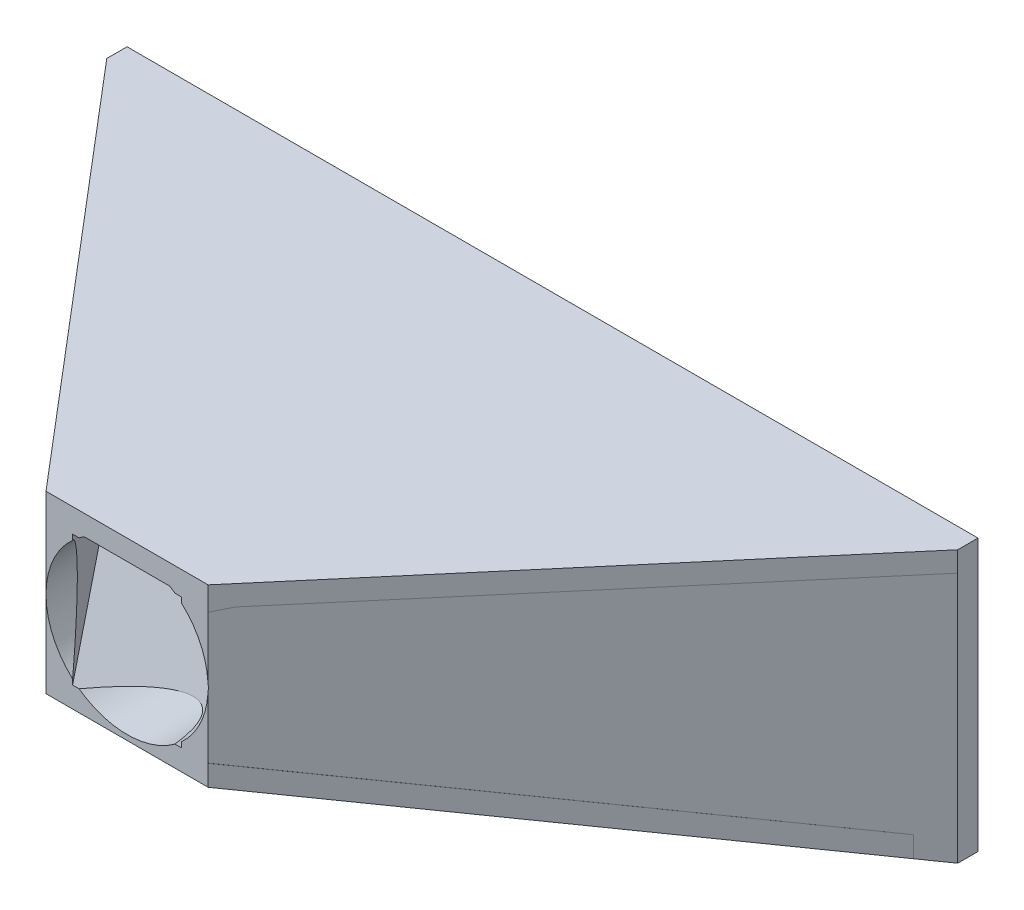
ISO-10303-21;
HEADER;
FILE_DESCRIPTION(('STEP AP214'),'2;1');
FILE_NAME('part.step','',(''),(''),'','','');
FILE_SCHEMA(('AUTOMOTIVE_DESIGN { 1 0 10303 214 1 1 1 1 }'));
ENDSEC;
DATA;
#1=APPLICATION_CONTEXT('core data for automotive mechanical design processes');
#2=APPLICATION_PROTOCOL_DEFINITION('international standard','automotive_design',2000,#1);
#3=PRODUCT_CONTEXT('',#1,'mechanical');
#4=PRODUCT('Part','Part','',(#3));
#5=PRODUCT_RELATED_PRODUCT_CATEGORY('part','',(#4));
#6=PRODUCT_DEFINITION_FORMATION('','',#4);
#7=PRODUCT_DEFINITION_CONTEXT('part definition',#1,'design');
#8=PRODUCT_DEFINITION('design','',#6,#7);
#9=PRODUCT_DEFINITION_SHAPE('','',#8);
#10=(LENGTH_UNIT() NAMED_UNIT(*) SI_UNIT(.MILLI.,.METRE.));
#11=(NAMED_UNIT(*) PLANE_ANGLE_UNIT() SI_UNIT($,.RADIAN.));
#12=(NAMED_UNIT(*) SI_UNIT($,.STERADIAN.) SOLID_ANGLE_UNIT());
#13=UNCERTAINTY_MEASURE_WITH_UNIT(LENGTH_MEASURE(1.E-05),#10,'distance_accuracy_value','');
#14=(GEOMETRIC_REPRESENTATION_CONTEXT(3) GLOBAL_UNCERTAINTY_ASSIGNED_CONTEXT((#13)) GLOBAL_UNIT_ASSIGNED_CONTEXT((#10,
#11,#12)) REPRESENTATION_CONTEXT('',''));
#15=CARTESIAN_POINT('',(0.,0.,0.));
#16=DIRECTION('',(0.,0.,1.));
#17=DIRECTION('',(1.,0.,0.));
#18=AXIS2_PLACEMENT_3D('',#15,#16,#17);
#19=CARTESIAN_POINT('',(0.,13.0412563891839,5.));
#20=DIRECTION('',(0.,0.972969357559378,0.230934253090552));
#21=DIRECTION('',(0.,-0.230934253090552,0.972969357559378));
#22=AXIS2_PLACEMENT_3D('',#19,#20,#21);
#23=PLANE('',#22);
#24=DIRECTION('',(0.637310525923257,-0.177959573712779,0.749777089321478));
#25=VECTOR('',#24,1.);
#26=CARTESIAN_POINT('',(-2.04434511752815,14.0483316344478,0.757002950904125));
#27=LINE('',#26,#25);
#28=CARTESIAN_POINT('',(83.4325635566118,-9.81983562655832,101.318071979304));
#29=VERTEX_POINT('',#28);
#30=CARTESIAN_POINT('',(86.5622023742034,-10.6937411517287,105.));
#31=VERTEX_POINT('',#30);
#32=EDGE_CURVE('E353',#29,#31,#27,.T.);
#33=ORIENTED_EDGE('',*,*,#32,.F.);
#34=DIRECTION('',(1.,0.,0.));
#35=VECTOR('',#34,1.);
#36=CARTESIAN_POINT('',(0.,-9.81983562655832,101.318071979304));
#37=LINE('',#36,#35);
#38=CARTESIAN_POINT('',(89.4643462471473,-9.81983562655832,101.318071979304));
#39=VERTEX_POINT('',#38);
#40=EDGE_CURVE('E272',#29,#39,#37,.T.);
#41=ORIENTED_EDGE('',*,*,#40,.T.);
#42=CARTESIAN_POINT('',(100.,-26.8198356265583,172.942263094962));
#43=DIRECTION('',(0.,0.972969357559378,0.230934253090552));
#44=DIRECTION('',(0.,-0.230934253090552,0.972969357559378));
#45=AXIS2_PLACEMENT_3D('',#42,#43,#44);
#46=ELLIPSE('',#45,86.6047359035898,20.);
#47=CARTESIAN_POINT('',(88.1699925194923,-10.6937411517287,105.));
#48=VERTEX_POINT('',#47);
#49=EDGE_CURVE('E298',#39,#48,#46,.T.);
#50=ORIENTED_EDGE('',*,*,#49,.T.);
#51=DIRECTION('',(1.,0.,0.));
#52=VECTOR('',#51,1.);
#53=CARTESIAN_POINT('',(0.,-10.6937411517287,105.));
#54=LINE('',#53,#52);
#55=EDGE_CURVE('E350',#31,#48,#54,.T.);
#56=ORIENTED_EDGE('',*,*,#55,.F.);
#57=EDGE_LOOP('',(#33,#41,#50,#56));
#58=FACE_BOUND('',#57,.T.);
#59=ADVANCED_FACE('F38',(#58),#23,.F.);
#60=CARTESIAN_POINT('',(100.,-26.8198356265583,0.));
#61=DIRECTION('',(0.,0.,1.));
#62=DIRECTION('',(1.,0.,0.));
#63=AXIS2_PLACEMENT_3D('',#60,#61,#62);
#64=CYLINDRICAL_SURFACE('',#63,20.);
#65=CARTESIAN_POINT('',(100.,-26.8198356265583,105.));
#66=DIRECTION('',(0.,0.,-1.));
#67=DIRECTION('',(-1.,0.,0.));
#68=AXIS2_PLACEMENT_3D('',#65,#66,#67);
#69=CIRCLE('',#68,20.);
#70=CARTESIAN_POINT('',(110.535653752853,-9.81983562655832,105.));
#71=VERTEX_POINT('',#70);
#72=CARTESIAN_POINT('',(111.830007480508,-10.6937411517287,105.));
#73=VERTEX_POINT('',#72);
#74=EDGE_CURVE('E354',#71,#73,#69,.T.);
#75=ORIENTED_EDGE('',*,*,#74,.F.);
#76=DIRECTION('',(0.,0.,1.));
#77=VECTOR('',#76,1.);
#78=CARTESIAN_POINT('',(110.535653752853,-9.81983562655832,0.));
#79=LINE('',#78,#77);
#80=CARTESIAN_POINT('',(110.535653752853,-9.81983562655832,101.318071979304));
#81=VERTEX_POINT('',#80);
#82=EDGE_CURVE('E11',#71,#81,#79,.F.);
#83=ORIENTED_EDGE('',*,*,#82,.T.);
#84=EDGE_CURVE('E299',#73,#81,#46,.T.);
#85=ORIENTED_EDGE('',*,*,#84,.F.);
#86=EDGE_LOOP('',(#75,#83,#85));
#87=FACE_BOUND('',#86,.T.);
#88=ADVANCED_FACE('F497',(#87),#64,.F.);
#89=CARTESIAN_POINT('',(121.427258934593,18.1801643734417,103.268342594403));
#90=DIRECTION('',(-0.76176849074944,0.,-0.647849339353928));
#91=DIRECTION('',(-0.647849339353928,0.,0.76176849074944));
#92=AXIS2_PLACEMENT_3D('',#89,#90,#91);
#93=PLANE('',#92);
#94=DIRECTION('',(0.,1.,0.));
#95=VECTOR('',#94,1.);
#96=CARTESIAN_POINT('',(205.,18.1801643734417,5.));
#97=LINE('',#96,#95);
#98=CARTESIAN_POINT('',(205.,-71.8198356265583,5.));
#99=VERTEX_POINT('',#98);
#100=CARTESIAN_POINT('',(205.,-9.81983562655832,5.));
#101=VERTEX_POINT('',#100);
#102=EDGE_CURVE('E409',#99,#101,#97,.T.);
#103=ORIENTED_EDGE('',*,*,#102,.T.);
#104=DIRECTION('',(-0.647849339353928,0.,0.76176849074944));
#105=VECTOR('',#104,1.);
#106=CARTESIAN_POINT('',(121.427258934593,-9.81983562655832,103.268342594403));
#107=LINE('',#106,#105);
#108=CARTESIAN_POINT('',(123.085875095403,-9.81983562655833,101.318071979304));
#109=VERTEX_POINT('',#108);
#110=EDGE_CURVE('E291',#101,#109,#107,.T.);
#111=ORIENTED_EDGE('',*,*,#110,.T.);
#112=DIRECTION('',(0.637512764131214,0.177920938287359,-0.749614311021825));
#113=VECTOR('',#112,1.);
#114=CARTESIAN_POINT('',(124.655716192642,-9.38171482851669,99.472186816323));
#115=LINE('',#114,#113);
#116=CARTESIAN_POINT('',(119.954563332416,-10.6937411517287,105.));
#117=VERTEX_POINT('',#116);
#118=EDGE_CURVE('E358',#117,#109,#115,.T.);
#119=ORIENTED_EDGE('',*,*,#118,.F.);
#120=DIRECTION('',(0.,-1.,0.));
#121=VECTOR('',#120,1.);
#122=CARTESIAN_POINT('',(119.954563332416,18.1801643734417,105.));
#123=LINE('',#122,#121);
#124=CARTESIAN_POINT('',(119.954563332416,-25.4724670011957,105.));
#125=VERTEX_POINT('',#124);
#126=EDGE_CURVE('E375',#117,#125,#123,.T.);
#127=ORIENTED_EDGE('',*,*,#126,.T.);
#128=CARTESIAN_POINT('',(100.,-26.8198356265583,128.463414516186));
#129=DIRECTION('',(-0.76176849074944,0.,-0.647849339353928));
#130=DIRECTION('',(-0.647849339353928,0.,0.76176849074944));
#131=AXIS2_PLACEMENT_3D('',#128,#129,#130);
#132=ELLIPSE('',#131,30.8713751563676,20.);
#133=CARTESIAN_POINT('',(119.954563332416,-28.1672042519212,105.));
#134=VERTEX_POINT('',#133);
#135=EDGE_CURVE('E293',#125,#134,#132,.T.);
#136=ORIENTED_EDGE('',*,*,#135,.T.);
#137=CARTESIAN_POINT('',(119.954563332416,-42.9459301013879,105.));
#138=VERTEX_POINT('',#137);
#139=EDGE_CURVE('E379',#134,#138,#123,.T.);
#140=ORIENTED_EDGE('',*,*,#139,.T.);
#141=DIRECTION('',(-0.637512764131214,0.177920938287359,0.749614311021825));
#142=VECTOR('',#141,1.);
#143=CARTESIAN_POINT('',(114.447297967847,-41.4089289993051,111.47567415768));
#144=LINE('',#143,#142);
#145=CARTESIAN_POINT('',(200.,-65.2854972423318,10.8792102150565));
#146=VERTEX_POINT('',#145);
#147=EDGE_CURVE('E342',#146,#138,#144,.T.);
#148=ORIENTED_EDGE('',*,*,#147,.F.);
#149=DIRECTION('',(0.,-1.,0.));
#150=VECTOR('',#149,1.);
#151=CARTESIAN_POINT('',(200.,18.1801643734417,10.8792102150565));
#152=LINE('',#151,#150);
#153=CARTESIAN_POINT('',(200.,-70.4244052265896,10.8792102150565));
#154=VERTEX_POINT('',#153);
#155=EDGE_CURVE('E344',#146,#154,#152,.T.);
#156=ORIENTED_EDGE('',*,*,#155,.T.);
#157=DIRECTION('',(0.637512764131214,-0.177920938287359,-0.749614311021825));
#158=VECTOR('',#157,1.);
#159=CARTESIAN_POINT('',(113.864407724268,-46.3851604304159,112.161061012541));
#160=LINE('',#159,#158);
#161=EDGE_CURVE('E307',#154,#99,#160,.T.);
#162=ORIENTED_EDGE('',*,*,#161,.T.);
#163=EDGE_LOOP('',(#103,#111,#119,#127,#136,#140,#148,#156,#162));
#164=FACE_BOUND('',#163,.T.);
#165=ADVANCED_FACE('F507',(#164),#93,.F.);
#166=CARTESIAN_POINT('',(117.670709797269,18.1801643734417,100.020103327679));
#167=DIRECTION('',(0.761939317759459,0.,0.647648420095541));
#168=DIRECTION('',(0.647648420095541,0.,-0.761939317759459));
#169=AXIS2_PLACEMENT_3D('',#166,#167,#168);
#170=PLANE('',#169);
#171=DIRECTION('',(-0.637310525923257,-0.177959573712779,0.749777089321478));
#172=VECTOR('',#171,1.);
#173=CARTESIAN_POINT('',(120.811403827013,-8.63477026874612,96.3251691750401));
#174=LINE('',#173,#172);
#175=CARTESIAN_POINT('',(116.567436443388,-9.81983562655832,101.318071979304));
#176=VERTEX_POINT('',#175);
#177=CARTESIAN_POINT('',(113.437797625797,-10.6937411517287,105.));
#178=VERTEX_POINT('',#177);
#179=EDGE_CURVE('E356',#176,#178,#174,.T.);
#180=ORIENTED_EDGE('',*,*,#179,.F.);
#181=DIRECTION('',(0.647648420095541,0.,-0.761939317759459));
#182=VECTOR('',#181,1.);
#183=CARTESIAN_POINT('',(117.670709797269,-9.81983562655832,100.020103327679));
#184=LINE('',#183,#182);
#185=CARTESIAN_POINT('',(198.437797625797,-9.81983562655832,5.));
#186=VERTEX_POINT('',#185);
#187=EDGE_CURVE('E284',#176,#186,#184,.T.);
#188=ORIENTED_EDGE('',*,*,#187,.T.);
#189=DIRECTION('',(0.,-1.,0.));
#190=VECTOR('',#189,1.);
#191=CARTESIAN_POINT('',(198.437797625797,18.1801643734417,5.));
#192=LINE('',#191,#190);
#193=CARTESIAN_POINT('',(198.437797625797,-66.6809276423006,5.));
#194=VERTEX_POINT('',#193);
#195=EDGE_CURVE('E380',#186,#194,#192,.T.);
#196=ORIENTED_EDGE('',*,*,#195,.T.);
#197=DIRECTION('',(0.637310525923257,-0.177959573712779,-0.749777089321478));
#198=VECTOR('',#197,1.);
#199=CARTESIAN_POINT('',(110.604007970575,-42.1546360955274,108.333870182613));
#200=LINE('',#199,#198);
#201=CARTESIAN_POINT('',(113.437797625797,-42.9459301013879,105.));
#202=VERTEX_POINT('',#201);
#203=EDGE_CURVE('E339',#202,#194,#200,.T.);
#204=ORIENTED_EDGE('',*,*,#203,.F.);
#205=DIRECTION('',(0.,-1.,0.));
#206=VECTOR('',#205,1.);
#207=CARTESIAN_POINT('',(113.437797625797,18.1801643734417,105.));
#208=LINE('',#207,#206);
#209=CARTESIAN_POINT('',(113.437797625797,-41.6328567555561,105.));
#210=VERTEX_POINT('',#209);
#211=EDGE_CURVE('E372',#210,#202,#208,.T.);
#212=ORIENTED_EDGE('',*,*,#211,.F.);
#213=CARTESIAN_POINT('',(100.,-26.8198356265583,120.809173677408));
#214=DIRECTION('',(0.761939317759459,0.,0.647648420095541));
#215=DIRECTION('',(-0.647648420095541,0.,0.761939317759459));
#216=AXIS2_PLACEMENT_3D('',#213,#214,#215);
#217=ELLIPSE('',#216,30.8809523491922,20.);
#218=CARTESIAN_POINT('',(113.437797625797,-12.0068144975605,105.));
#219=VERTEX_POINT('',#218);
#220=EDGE_CURVE('E304',#210,#219,#217,.T.);
#221=ORIENTED_EDGE('',*,*,#220,.T.);
#222=EDGE_CURVE('E382',#178,#219,#208,.T.);
#223=ORIENTED_EDGE('',*,*,#222,.F.);
#224=EDGE_LOOP('',(#180,#188,#196,#204,#212,#221,#223));
#225=FACE_BOUND('',#224,.T.);
#226=ADVANCED_FACE('F440',(#225),#170,.F.);
#227=CARTESIAN_POINT('',(-1.5604050077194,18.1801643734417,1.32634425656149));
#228=DIRECTION('',(0.761939317759459,0.,-0.647648420095541));
#229=DIRECTION('',(-0.647648420095541,0.,-0.761939317759459));
#230=AXIS2_PLACEMENT_3D('',#227,#228,#229);
#231=PLANE('',#230);
#232=DIRECTION('',(-0.647648420095541,0.,-0.761939317759459));
#233=VECTOR('',#232,1.);
#234=CARTESIAN_POINT('',(-1.5604050077194,-9.81983562655832,1.32634425656149));
#235=LINE('',#234,#233);
#236=CARTESIAN_POINT('',(1.56220237420334,-9.81983562655832,5.));
#237=VERTEX_POINT('',#236);
#238=EDGE_CURVE('E275',#29,#237,#235,.T.);
#239=ORIENTED_EDGE('',*,*,#238,.F.);
#240=ORIENTED_EDGE('',*,*,#32,.T.);
#241=DIRECTION('',(0.,-1.,0.));
#242=VECTOR('',#241,1.);
#243=CARTESIAN_POINT('',(86.5622023742034,18.1801643734417,105.));
#244=LINE('',#243,#242);
#245=CARTESIAN_POINT('',(86.5622023742034,-12.0068144975606,105.));
#246=VERTEX_POINT('',#245);
#247=EDGE_CURVE('E361',#31,#246,#244,.T.);
#248=ORIENTED_EDGE('',*,*,#247,.T.);
#249=CARTESIAN_POINT('',(100.,-26.8198356265583,120.809173677408));
#250=DIRECTION('',(0.761939317759459,0.,-0.647648420095541));
#251=DIRECTION('',(0.647648420095541,0.,0.761939317759459));
#252=AXIS2_PLACEMENT_3D('',#249,#250,#251);
#253=ELLIPSE('',#252,30.8809523491922,20.);
#254=CARTESIAN_POINT('',(86.5622023742034,-41.632856755556,105.));
#255=VERTEX_POINT('',#254);
#256=EDGE_CURVE('E296',#255,#246,#253,.T.);
#257=ORIENTED_EDGE('',*,*,#256,.F.);
#258=CARTESIAN_POINT('',(86.5622023742034,-42.9459301013879,105.));
#259=VERTEX_POINT('',#258);
#260=EDGE_CURVE('E365',#255,#259,#244,.T.);
#261=ORIENTED_EDGE('',*,*,#260,.T.);
#262=DIRECTION('',(-0.637310525923257,-0.177959573712779,-0.749777089321478));
#263=VECTOR('',#262,1.);
#264=CARTESIAN_POINT('',(8.16305073890912,-64.8377379987214,12.7657039584774));
#265=LINE('',#264,#263);
#266=CARTESIAN_POINT('',(1.56220237420334,-66.6809276423006,5.));
#267=VERTEX_POINT('',#266);
#268=EDGE_CURVE('E336',#259,#267,#265,.T.);
#269=ORIENTED_EDGE('',*,*,#268,.T.);
#270=DIRECTION('',(0.,-1.,0.));
#271=VECTOR('',#270,1.);
#272=CARTESIAN_POINT('',(1.56220237420334,18.1801643734417,5.));
#273=LINE('',#272,#271);
#274=EDGE_CURVE('E233',#237,#267,#273,.T.);
#275=ORIENTED_EDGE('',*,*,#274,.F.);
#276=EDGE_LOOP('',(#239,#240,#248,#257,#261,#269,#275));
#277=FACE_BOUND('',#276,.T.);
#278=ADVANCED_FACE('F465',(#277),#231,.T.);
#279=CARTESIAN_POINT('',(-5.37010159651669,18.1801643734417,4.56458635703919));
#280=DIRECTION('',(0.761939317759459,0.,-0.647648420095541));
#281=DIRECTION('',(-0.647648420095541,0.,-0.761939317759459));
#282=AXIS2_PLACEMENT_3D('',#279,#280,#281);
#283=PLANE('',#282);
#284=DIRECTION('',(0.,-1.,0.));
#285=VECTOR('',#284,1.);
#286=CARTESIAN_POINT('',(80.0000000000001,18.1801643734417,105.));
#287=LINE('',#286,#285);
#288=CARTESIAN_POINT('',(80.0000000000001,-4.81983562655832,105.));
#289=VERTEX_POINT('',#288);
#290=CARTESIAN_POINT('',(80.0000000000001,-26.8198356265583,105.));
#291=VERTEX_POINT('',#290);
#292=EDGE_CURVE('E222',#289,#291,#287,.T.);
#293=ORIENTED_EDGE('',*,*,#292,.F.);
#294=DIRECTION('',(0.647648420095541,0.,0.761939317759459));
#295=VECTOR('',#294,1.);
#296=CARTESIAN_POINT('',(80.0000000000001,-4.81983562655832,105.));
#297=LINE('',#296,#295);
#298=CARTESIAN_POINT('',(-5.,-4.81983562655832,5.));
#299=VERTEX_POINT('',#298);
#300=EDGE_CURVE('E226',#299,#289,#297,.T.);
#301=ORIENTED_EDGE('',*,*,#300,.F.);
#302=DIRECTION('',(0.,-1.,0.));
#303=VECTOR('',#302,1.);
#304=CARTESIAN_POINT('',(-5.,18.1801643734417,5.));
#305=LINE('',#304,#303);
#306=CARTESIAN_POINT('',(-5.,-71.8198356265583,5.));
#307=VERTEX_POINT('',#306);
#308=EDGE_CURVE('E404',#299,#307,#305,.T.);
#309=ORIENTED_EDGE('',*,*,#308,.T.);
#310=DIRECTION('',(0.637310525923257,0.177959573712779,0.749777089321478));
#311=VECTOR('',#310,1.);
#312=CARTESIAN_POINT('',(4.84901523309676,-69.0696432461117,16.5870767448197));
#313=LINE('',#312,#311);
#314=CARTESIAN_POINT('',(80.0000000000001,-48.0848380856457,105.));
#315=VERTEX_POINT('',#314);
#316=EDGE_CURVE('E310',#307,#315,#313,.T.);
#317=ORIENTED_EDGE('',*,*,#316,.T.);
#318=EDGE_CURVE('E229',#291,#315,#287,.T.);
#319=ORIENTED_EDGE('',*,*,#318,.F.);
#320=EDGE_LOOP('',(#293,#301,#309,#317,#319));
#321=FACE_BOUND('',#320,.T.);
#322=ADVANCED_FACE('F224',(#321),#283,.F.);
#323=CARTESIAN_POINT('',(0.,18.1801643734417,105.));
#324=DIRECTION('',(0.,0.,-1.));
#325=DIRECTION('',(-1.,0.,0.));
#326=AXIS2_PLACEMENT_3D('',#323,#324,#325);
#327=PLANE('',#326);
#328=CARTESIAN_POINT('',(89.4643462471473,-9.81983562655832,105.));
#329=VERTEX_POINT('',#328);
#330=EDGE_CURVE('E351',#48,#329,#69,.T.);
#331=ORIENTED_EDGE('',*,*,#330,.T.);
#332=DIRECTION('',(1.,0.,0.));
#333=VECTOR('',#332,1.);
#334=CARTESIAN_POINT('',(120.,-9.81983562655832,105.));
#335=LINE('',#334,#333);
#336=EDGE_CURVE('E265',#329,#71,#335,.T.);
#337=ORIENTED_EDGE('',*,*,#336,.T.);
#338=ORIENTED_EDGE('',*,*,#74,.T.);
#339=EDGE_CURVE('E349',#73,#178,#54,.T.);
#340=ORIENTED_EDGE('',*,*,#339,.T.);
#341=ORIENTED_EDGE('',*,*,#222,.T.);
#342=CARTESIAN_POINT('',(100.,-26.8198356265583,105.));
#343=DIRECTION('',(0.,0.,1.));
#344=DIRECTION('',(1.,0.,0.));
#345=AXIS2_PLACEMENT_3D('',#342,#343,#344);
#346=CIRCLE('',#345,20.);
#347=EDGE_CURVE('E370',#125,#219,#346,.T.);
#348=ORIENTED_EDGE('',*,*,#347,.F.);
#349=ORIENTED_EDGE('',*,*,#126,.F.);
#350=CARTESIAN_POINT('',(120.,-10.6937411517287,105.));
#351=VERTEX_POINT('',#350);
#352=EDGE_CURVE('E347',#117,#351,#54,.T.);
#353=ORIENTED_EDGE('',*,*,#352,.T.);
#354=DIRECTION('',(0.,-1.,0.));
#355=VECTOR('',#354,1.);
#356=CARTESIAN_POINT('',(120.,128.180164373442,105.));
#357=LINE('',#356,#355);
#358=CARTESIAN_POINT('',(120.,-4.81983562655832,105.));
#359=VERTEX_POINT('',#358);
#360=EDGE_CURVE('E241',#359,#351,#357,.T.);
#361=ORIENTED_EDGE('',*,*,#360,.F.);
#362=DIRECTION('',(1.,0.,0.));
#363=VECTOR('',#362,1.);
#364=CARTESIAN_POINT('',(120.,-4.81983562655832,105.));
#365=LINE('',#364,#363);
#366=EDGE_CURVE('E236',#289,#359,#365,.T.);
#367=ORIENTED_EDGE('',*,*,#366,.F.);
#368=ORIENTED_EDGE('',*,*,#292,.T.);
#369=CARTESIAN_POINT('',(100.,-26.8198356265583,105.));
#370=DIRECTION('',(0.,0.,-1.));
#371=DIRECTION('',(-1.,0.,0.));
#372=AXIS2_PLACEMENT_3D('',#369,#370,#371);
#373=CIRCLE('',#372,20.);
#374=EDGE_CURVE('E369',#291,#246,#373,.T.);
#375=ORIENTED_EDGE('',*,*,#374,.T.);
#376=ORIENTED_EDGE('',*,*,#247,.F.);
#377=ORIENTED_EDGE('',*,*,#55,.T.);
#378=EDGE_LOOP('',(#331,#337,#338,#340,#341,#348,#349,#353,#361,#367,#368,#375,#376,#377));
#379=FACE_BOUND('',#378,.T.);
#380=ADVANCED_FACE('F238',(#379),#327,.F.);
#381=CARTESIAN_POINT('',(0.,0.,0.));
#382=DIRECTION('',(0.,0.,-1.));
#383=DIRECTION('',(-1.,0.,0.));
#384=AXIS2_PLACEMENT_3D('',#381,#382,#383);
#385=PLANE('',#384);
#386=DIRECTION('',(0.,-1.,0.));
#387=VECTOR('',#386,1.);
#388=CARTESIAN_POINT('',(-5.,18.1801643734417,0.));
#389=LINE('',#388,#387);
#390=CARTESIAN_POINT('',(-5.,-4.81983562655832,0.));
#391=VERTEX_POINT('',#390);
#392=CARTESIAN_POINT('',(-5.,-71.8198356265583,0.));
#393=VERTEX_POINT('',#392);
#394=EDGE_CURVE('E403',#391,#393,#389,.T.);
#395=ORIENTED_EDGE('',*,*,#394,.F.);
#396=DIRECTION('',(-1.,0.,0.));
#397=VECTOR('',#396,1.);
#398=CARTESIAN_POINT('',(-5.,-4.81983562655832,0.));
#399=LINE('',#398,#397);
#400=CARTESIAN_POINT('',(205.,-4.81983562655832,0.));
#401=VERTEX_POINT('',#400);
#402=EDGE_CURVE('E261',#401,#391,#399,.T.);
#403=ORIENTED_EDGE('',*,*,#402,.F.);
#404=DIRECTION('',(0.,1.,0.));
#405=VECTOR('',#404,1.);
#406=CARTESIAN_POINT('',(205.,18.1801643734417,0.));
#407=LINE('',#406,#405);
#408=CARTESIAN_POINT('',(205.,-71.8198356265583,0.));
#409=VERTEX_POINT('',#408);
#410=EDGE_CURVE('E407',#409,#401,#407,.T.);
#411=ORIENTED_EDGE('',*,*,#410,.F.);
#412=DIRECTION('',(1.,0.,0.));
#413=VECTOR('',#412,1.);
#414=CARTESIAN_POINT('',(-5.,-71.8198356265583,0.));
#415=LINE('',#414,#413);
#416=EDGE_CURVE('E413',#393,#409,#415,.T.);
#417=ORIENTED_EDGE('',*,*,#416,.F.);
#418=EDGE_LOOP('',(#395,#403,#411,#417));
#419=FACE_BOUND('',#418,.T.);
#420=DIRECTION('',(0.,1.,0.));
#421=VECTOR('',#420,1.);
#422=CARTESIAN_POINT('',(200.,13.1801643734417,0.));
#423=LINE('',#422,#421);
#424=CARTESIAN_POINT('',(200.,-66.8198356265583,0.));
#425=VERTEX_POINT('',#424);
#426=CARTESIAN_POINT('',(200.,-9.81983562655832,0.));
#427=VERTEX_POINT('',#426);
#428=EDGE_CURVE('E388',#425,#427,#423,.T.);
#429=ORIENTED_EDGE('',*,*,#428,.T.);
#430=DIRECTION('',(-1.,0.,0.));
#431=VECTOR('',#430,1.);
#432=CARTESIAN_POINT('',(-5.,-9.81983562655832,0.));
#433=LINE('',#432,#431);
#434=CARTESIAN_POINT('',(0.,-9.81983562655832,0.));
#435=VERTEX_POINT('',#434);
#436=EDGE_CURVE('E251',#427,#435,#433,.T.);
#437=ORIENTED_EDGE('',*,*,#436,.T.);
#438=DIRECTION('',(0.,-1.,0.));
#439=VECTOR('',#438,1.);
#440=CARTESIAN_POINT('',(0.,13.1801643734417,0.));
#441=LINE('',#440,#439);
#442=CARTESIAN_POINT('',(0.,-66.8198356265583,0.));
#443=VERTEX_POINT('',#442);
#444=EDGE_CURVE('E378',#435,#443,#441,.T.);
#445=ORIENTED_EDGE('',*,*,#444,.T.);
#446=DIRECTION('',(1.,0.,0.));
#447=VECTOR('',#446,1.);
#448=CARTESIAN_POINT('',(0.,-66.8198356265583,0.));
#449=LINE('',#448,#447);
#450=EDGE_CURVE('E395',#443,#425,#449,.T.);
#451=ORIENTED_EDGE('',*,*,#450,.T.);
#452=EDGE_LOOP('',(#429,#437,#445,#451));
#453=FACE_BOUND('',#452,.T.);
#454=ADVANCED_FACE('F481',(#419,#453),#385,.T.);
#455=CARTESIAN_POINT('',(-5.,18.1801643734417,5.));
#456=DIRECTION('',(1.,0.,0.));
#457=DIRECTION('',(0.,0.,-1.));
#458=AXIS2_PLACEMENT_3D('',#455,#456,#457);
#459=PLANE('',#458);
#460=ORIENTED_EDGE('',*,*,#308,.F.);
#461=DIRECTION('',(0.,0.,1.));
#462=VECTOR('',#461,1.);
#463=CARTESIAN_POINT('',(-5.,-4.81983562655832,5.));
#464=LINE('',#463,#462);
#465=EDGE_CURVE('E250',#391,#299,#464,.T.);
#466=ORIENTED_EDGE('',*,*,#465,.F.);
#467=ORIENTED_EDGE('',*,*,#394,.T.);
#468=DIRECTION('',(0.,0.,-1.));
#469=VECTOR('',#468,1.);
#470=CARTESIAN_POINT('',(-5.,-71.8198356265583,5.));
#471=LINE('',#470,#469);
#472=EDGE_CURVE('E418',#307,#393,#471,.T.);
#473=ORIENTED_EDGE('',*,*,#472,.F.);
#474=EDGE_LOOP('',(#460,#466,#467,#473));
#475=FACE_BOUND('',#474,.T.);
#476=ADVANCED_FACE('F40',(#475),#459,.F.);
#477=CARTESIAN_POINT('',(-5.,-71.8198356265583,5.));
#478=DIRECTION('',(0.,1.,0.));
#479=DIRECTION('',(0.,0.,1.));
#480=AXIS2_PLACEMENT_3D('',#477,#478,#479);
#481=PLANE('',#480);
#482=DIRECTION('',(0.,0.,-1.));
#483=VECTOR('',#482,1.);
#484=CARTESIAN_POINT('',(205.,-71.8198356265583,5.));
#485=LINE('',#484,#483);
#486=EDGE_CURVE('E411',#99,#409,#485,.T.);
#487=ORIENTED_EDGE('',*,*,#486,.F.);
#488=DIRECTION('',(1.,0.,0.));
#489=VECTOR('',#488,1.);
#490=CARTESIAN_POINT('',(-5.,-71.8198356265583,5.));
#491=LINE('',#490,#489);
#492=EDGE_CURVE('E406',#307,#99,#491,.T.);
#493=ORIENTED_EDGE('',*,*,#492,.F.);
#494=ORIENTED_EDGE('',*,*,#472,.T.);
#495=ORIENTED_EDGE('',*,*,#416,.T.);
#496=EDGE_LOOP('',(#487,#493,#494,#495));
#497=FACE_BOUND('',#496,.T.);
#498=ADVANCED_FACE('F548',(#497),#481,.F.);
#499=CARTESIAN_POINT('',(205.,18.1801643734417,5.));
#500=DIRECTION('',(-1.,0.,0.));
#501=DIRECTION('',(0.,0.,1.));
#502=AXIS2_PLACEMENT_3D('',#499,#500,#501);
#503=PLANE('',#502);
#504=ORIENTED_EDGE('',*,*,#410,.T.);
#505=DIRECTION('',(0.,0.,-1.));
#506=VECTOR('',#505,1.);
#507=CARTESIAN_POINT('',(205.,-4.81983562655832,0.));
#508=LINE('',#507,#506);
#509=CARTESIAN_POINT('',(205.,-4.81983562655832,5.));
#510=VERTEX_POINT('',#509);
#511=EDGE_CURVE('E258',#510,#401,#508,.T.);
#512=ORIENTED_EDGE('',*,*,#511,.F.);
#513=DIRECTION('',(0.,-1.,0.));
#514=VECTOR('',#513,1.);
#515=CARTESIAN_POINT('',(205.,-4.81983562655832,5.));
#516=LINE('',#515,#514);
#517=EDGE_CURVE('E264',#510,#101,#516,.T.);
#518=ORIENTED_EDGE('',*,*,#517,.T.);
#519=ORIENTED_EDGE('',*,*,#102,.F.);
#520=ORIENTED_EDGE('',*,*,#486,.T.);
#521=EDGE_LOOP('',(#504,#512,#518,#519,#520));
#522=FACE_BOUND('',#521,.T.);
#523=ADVANCED_FACE('F538',(#522),#503,.F.);
#524=CARTESIAN_POINT('',(0.,13.1801643734417,5.));
#525=DIRECTION('',(1.,0.,0.));
#526=DIRECTION('',(0.,0.,-1.));
#527=AXIS2_PLACEMENT_3D('',#524,#525,#526);
#528=PLANE('',#527);
#529=DIRECTION('',(0.,0.,-1.));
#530=VECTOR('',#529,1.);
#531=CARTESIAN_POINT('',(0.,-9.81983562655832,5.));
#532=LINE('',#531,#530);
#533=CARTESIAN_POINT('',(0.,-9.81983562655832,5.));
#534=VERTEX_POINT('',#533);
#535=EDGE_CURVE('E281',#534,#435,#532,.T.);
#536=ORIENTED_EDGE('',*,*,#535,.F.);
#537=DIRECTION('',(0.,-1.,0.));
#538=VECTOR('',#537,1.);
#539=CARTESIAN_POINT('',(0.,13.1801643734417,5.));
#540=LINE('',#539,#538);
#541=CARTESIAN_POINT('',(0.,-66.8198356265583,5.));
#542=VERTEX_POINT('',#541);
#543=EDGE_CURVE('E385',#534,#542,#540,.T.);
#544=ORIENTED_EDGE('',*,*,#543,.T.);
#545=DIRECTION('',(0.,0.,-1.));
#546=VECTOR('',#545,1.);
#547=CARTESIAN_POINT('',(0.,-66.8198356265583,5.));
#548=LINE('',#547,#546);
#549=EDGE_CURVE('E400',#542,#443,#548,.T.);
#550=ORIENTED_EDGE('',*,*,#549,.T.);
#551=ORIENTED_EDGE('',*,*,#444,.F.);
#552=EDGE_LOOP('',(#536,#544,#550,#551));
#553=FACE_BOUND('',#552,.T.);
#554=ADVANCED_FACE('F477',(#553),#528,.T.);
#555=CARTESIAN_POINT('',(0.,-66.8198356265583,5.));
#556=DIRECTION('',(0.,1.,0.));
#557=DIRECTION('',(0.,0.,1.));
#558=AXIS2_PLACEMENT_3D('',#555,#556,#557);
#559=PLANE('',#558);
#560=ORIENTED_EDGE('',*,*,#450,.F.);
#561=ORIENTED_EDGE('',*,*,#549,.F.);
#562=DIRECTION('',(1.,0.,0.));
#563=VECTOR('',#562,1.);
#564=CARTESIAN_POINT('',(0.,-66.8198356265583,5.));
#565=LINE('',#564,#563);
#566=CARTESIAN_POINT('',(200.,-66.8198356265583,5.));
#567=VERTEX_POINT('',#566);
#568=EDGE_CURVE('E387',#542,#567,#565,.T.);
#569=ORIENTED_EDGE('',*,*,#568,.T.);
#570=DIRECTION('',(0.,0.,-1.));
#571=VECTOR('',#570,1.);
#572=CARTESIAN_POINT('',(200.,-66.8198356265583,5.));
#573=LINE('',#572,#571);
#574=EDGE_CURVE('E393',#567,#425,#573,.T.);
#575=ORIENTED_EDGE('',*,*,#574,.T.);
#576=EDGE_LOOP('',(#560,#561,#569,#575));
#577=FACE_BOUND('',#576,.T.);
#578=ADVANCED_FACE('F679',(#577),#559,.T.);
#579=CARTESIAN_POINT('',(200.,13.1801643734417,5.));
#580=DIRECTION('',(-1.,0.,0.));
#581=DIRECTION('',(0.,0.,1.));
#582=AXIS2_PLACEMENT_3D('',#579,#580,#581);
#583=PLANE('',#582);
#584=DIRECTION('',(0.,0.,1.));
#585=VECTOR('',#584,1.);
#586=CARTESIAN_POINT('',(200.,-9.81983562655832,5.));
#587=LINE('',#586,#585);
#588=CARTESIAN_POINT('',(200.,-9.81983562655832,5.));
#589=VERTEX_POINT('',#588);
#590=EDGE_CURVE('E288',#427,#589,#587,.T.);
#591=ORIENTED_EDGE('',*,*,#590,.F.);
#592=ORIENTED_EDGE('',*,*,#428,.F.);
#593=ORIENTED_EDGE('',*,*,#574,.F.);
#594=DIRECTION('',(0.,1.,0.));
#595=VECTOR('',#594,1.);
#596=CARTESIAN_POINT('',(200.,13.1801643734417,5.));
#597=LINE('',#596,#595);
#598=EDGE_CURVE('E390',#567,#589,#597,.T.);
#599=ORIENTED_EDGE('',*,*,#598,.T.);
#600=EDGE_LOOP('',(#591,#592,#593,#599));
#601=FACE_BOUND('',#600,.T.);
#602=ADVANCED_FACE('F487',(#601),#583,.T.);
#603=ORIENTED_EDGE('',*,*,#318,.T.);
#604=DIRECTION('',(1.,0.,0.));
#605=VECTOR('',#604,1.);
#606=CARTESIAN_POINT('',(0.,-48.0848380856457,105.));
#607=LINE('',#606,#605);
#608=CARTESIAN_POINT('',(120.,-48.0848380856457,105.));
#609=VERTEX_POINT('',#608);
#610=EDGE_CURVE('E333',#315,#609,#607,.T.);
#611=ORIENTED_EDGE('',*,*,#610,.T.);
#612=CARTESIAN_POINT('',(120.,-42.9459301013879,105.));
#613=VERTEX_POINT('',#612);
#614=EDGE_CURVE('E312',#613,#609,#357,.T.);
#615=ORIENTED_EDGE('',*,*,#614,.F.);
#616=DIRECTION('',(1.,0.,0.));
#617=VECTOR('',#616,1.);
#618=CARTESIAN_POINT('',(0.,-42.9459301013879,105.));
#619=LINE('',#618,#617);
#620=EDGE_CURVE('E328',#138,#613,#619,.T.);
#621=ORIENTED_EDGE('',*,*,#620,.F.);
#622=ORIENTED_EDGE('',*,*,#139,.F.);
#623=EDGE_CURVE('E374',#210,#134,#346,.T.);
#624=ORIENTED_EDGE('',*,*,#623,.F.);
#625=ORIENTED_EDGE('',*,*,#211,.T.);
#626=CARTESIAN_POINT('',(111.830007480508,-42.9459301013879,105.));
#627=VERTEX_POINT('',#626);
#628=EDGE_CURVE('E331',#627,#202,#619,.T.);
#629=ORIENTED_EDGE('',*,*,#628,.F.);
#630=CARTESIAN_POINT('',(88.1699925194923,-42.9459301013879,105.));
#631=VERTEX_POINT('',#630);
#632=EDGE_CURVE('E373',#631,#627,#346,.T.);
#633=ORIENTED_EDGE('',*,*,#632,.F.);
#634=EDGE_CURVE('E332',#259,#631,#619,.T.);
#635=ORIENTED_EDGE('',*,*,#634,.F.);
#636=ORIENTED_EDGE('',*,*,#260,.F.);
#637=EDGE_CURVE('E364',#255,#291,#373,.T.);
#638=ORIENTED_EDGE('',*,*,#637,.T.);
#639=EDGE_LOOP('',(#603,#611,#615,#621,#622,#624,#625,#629,#633,#635,#636,#638));
#640=FACE_BOUND('',#639,.T.);
#641=ADVANCED_FACE('F450',(#640),#327,.F.);
#642=CARTESIAN_POINT('',(0.,18.1801643734417,5.));
#643=DIRECTION('',(0.,0.,1.));
#644=DIRECTION('',(1.,0.,0.));
#645=AXIS2_PLACEMENT_3D('',#642,#643,#644);
#646=PLANE('',#645);
#647=ORIENTED_EDGE('',*,*,#543,.F.);
#648=DIRECTION('',(1.,0.,0.));
#649=VECTOR('',#648,1.);
#650=CARTESIAN_POINT('',(0.,-9.81983562655832,5.));
#651=LINE('',#650,#649);
#652=EDGE_CURVE('E278',#534,#237,#651,.T.);
#653=ORIENTED_EDGE('',*,*,#652,.T.);
#654=ORIENTED_EDGE('',*,*,#274,.T.);
#655=DIRECTION('',(1.,0.,0.));
#656=VECTOR('',#655,1.);
#657=CARTESIAN_POINT('',(0.,-66.6809276423006,5.));
#658=LINE('',#657,#656);
#659=EDGE_CURVE('E325',#267,#194,#658,.T.);
#660=ORIENTED_EDGE('',*,*,#659,.T.);
#661=ORIENTED_EDGE('',*,*,#195,.F.);
#662=EDGE_CURVE('E282',#186,#589,#651,.T.);
#663=ORIENTED_EDGE('',*,*,#662,.T.);
#664=ORIENTED_EDGE('',*,*,#598,.F.);
#665=ORIENTED_EDGE('',*,*,#568,.F.);
#666=EDGE_LOOP('',(#647,#653,#654,#660,#661,#663,#664,#665));
#667=FACE_BOUND('',#666,.T.);
#668=ADVANCED_FACE('F471',(#667),#646,.F.);
#669=ORIENTED_EDGE('',*,*,#84,.T.);
#670=EDGE_CURVE('E276',#81,#176,#37,.T.);
#671=ORIENTED_EDGE('',*,*,#670,.T.);
#672=ORIENTED_EDGE('',*,*,#179,.T.);
#673=ORIENTED_EDGE('',*,*,#339,.F.);
#674=EDGE_LOOP('',(#669,#671,#672,#673));
#675=FACE_BOUND('',#674,.T.);
#676=ADVANCED_FACE('F510',(#675),#23,.F.);
#677=ORIENTED_EDGE('',*,*,#118,.T.);
#678=DIRECTION('',(1.,0.,0.));
#679=VECTOR('',#678,1.);
#680=CARTESIAN_POINT('',(0.,-9.81983562655832,101.318071979304));
#681=LINE('',#680,#679);
#682=CARTESIAN_POINT('',(123.129638817592,-9.81983562655833,101.318071979304));
#683=VERTEX_POINT('',#682);
#684=EDGE_CURVE('E286',#109,#683,#681,.T.);
#685=ORIENTED_EDGE('',*,*,#684,.T.);
#686=DIRECTION('',(-0.637310525923257,-0.177959573712779,0.749777089321478));
#687=VECTOR('',#686,1.);
#688=CARTESIAN_POINT('',(121.736235177221,-10.2089230615899,102.957370379739));
#689=LINE('',#688,#687);
#690=EDGE_CURVE('E318',#683,#351,#689,.T.);
#691=ORIENTED_EDGE('',*,*,#690,.T.);
#692=ORIENTED_EDGE('',*,*,#352,.F.);
#693=EDGE_LOOP('',(#677,#685,#691,#692));
#694=FACE_BOUND('',#693,.T.);
#695=ADVANCED_FACE('F511',(#694),#23,.F.);
#696=CARTESIAN_POINT('',(0.,-66.6809276423006,5.));
#697=DIRECTION('',(0.,-0.972969357559378,0.230934253090552));
#698=DIRECTION('',(0.,-0.230934253090552,-0.972969357559378));
#699=AXIS2_PLACEMENT_3D('',#696,#697,#698);
#700=PLANE('',#699);
#701=ORIENTED_EDGE('',*,*,#634,.T.);
#702=CARTESIAN_POINT('',(100.,-26.8198356265583,172.942263094962));
#703=DIRECTION('',(0.,-0.972969357559378,0.230934253090552));
#704=DIRECTION('',(0.,0.230934253090552,0.972969357559378));
#705=AXIS2_PLACEMENT_3D('',#702,#703,#704);
#706=ELLIPSE('',#705,86.6047359035898,20.);
#707=EDGE_CURVE('E301',#631,#627,#706,.T.);
#708=ORIENTED_EDGE('',*,*,#707,.T.);
#709=ORIENTED_EDGE('',*,*,#628,.T.);
#710=ORIENTED_EDGE('',*,*,#203,.T.);
#711=ORIENTED_EDGE('',*,*,#659,.F.);
#712=ORIENTED_EDGE('',*,*,#268,.F.);
#713=EDGE_LOOP('',(#701,#708,#709,#710,#711,#712));
#714=FACE_BOUND('',#713,.T.);
#715=ADVANCED_FACE('F492',(#714),#700,.F.);
#716=CARTESIAN_POINT('',(200.,0.,0.));
#717=DIRECTION('',(1.,0.,0.));
#718=DIRECTION('',(0.,0.,-1.));
#719=AXIS2_PLACEMENT_3D('',#716,#717,#718);
#720=PLANE('',#719);
#721=DIRECTION('',(0.,-1.,0.));
#722=VECTOR('',#721,1.);
#723=CARTESIAN_POINT('',(200.,128.180164373442,10.8823529411765));
#724=LINE('',#723,#722);
#725=CARTESIAN_POINT('',(200.,-65.2847513163645,10.8823529411766));
#726=VERTEX_POINT('',#725);
#727=CARTESIAN_POINT('',(200.,-70.4236593006222,10.8823529411765));
#728=VERTEX_POINT('',#727);
#729=EDGE_CURVE('E59',#726,#728,#724,.T.);
#730=ORIENTED_EDGE('',*,*,#729,.T.);
#731=DIRECTION('',(0.,0.230934253090552,0.972969357559378));
#732=VECTOR('',#731,1.);
#733=CARTESIAN_POINT('',(200.,-71.8198356265583,5.));
#734=LINE('',#733,#732);
#735=EDGE_CURVE('E320',#154,#728,#734,.T.);
#736=ORIENTED_EDGE('',*,*,#735,.F.);
#737=ORIENTED_EDGE('',*,*,#155,.F.);
#738=DIRECTION('',(0.,-0.230934253090552,-0.972969357559378));
#739=VECTOR('',#738,1.);
#740=CARTESIAN_POINT('',(200.,-66.6809276423006,5.));
#741=LINE('',#740,#739);
#742=EDGE_CURVE('E323',#726,#146,#741,.T.);
#743=ORIENTED_EDGE('',*,*,#742,.F.);
#744=EDGE_LOOP('',(#730,#736,#737,#743));
#745=FACE_BOUND('',#744,.T.);
#746=ADVANCED_FACE('F522',(#745),#720,.T.);
#747=CARTESIAN_POINT('',(0.,-71.8198356265583,5.));
#748=DIRECTION('',(0.,0.972969357559378,-0.230934253090552));
#749=DIRECTION('',(0.,0.230934253090552,0.972969357559378));
#750=AXIS2_PLACEMENT_3D('',#747,#748,#749);
#751=PLANE('',#750);
#752=ORIENTED_EDGE('',*,*,#735,.T.);
#753=DIRECTION('',(-0.637310525923257,0.177959573712779,0.749777089321478));
#754=VECTOR('',#753,1.);
#755=CARTESIAN_POINT('',(121.736235177221,-48.5696561757845,102.957370379739));
#756=LINE('',#755,#754);
#757=EDGE_CURVE('E314',#728,#609,#756,.T.);
#758=ORIENTED_EDGE('',*,*,#757,.T.);
#759=ORIENTED_EDGE('',*,*,#610,.F.);
#760=ORIENTED_EDGE('',*,*,#316,.F.);
#761=ORIENTED_EDGE('',*,*,#492,.T.);
#762=ORIENTED_EDGE('',*,*,#161,.F.);
#763=EDGE_LOOP('',(#752,#758,#759,#760,#761,#762));
#764=FACE_BOUND('',#763,.T.);
#765=ADVANCED_FACE('F551',(#764),#751,.F.);
#766=ORIENTED_EDGE('',*,*,#620,.T.);
#767=DIRECTION('',(0.637310525923257,-0.177959573712779,-0.749777089321478));
#768=VECTOR('',#767,1.);
#769=CARTESIAN_POINT('',(121.736235177221,-43.4307481915267,102.957370379739));
#770=LINE('',#769,#768);
#771=EDGE_CURVE('E421',#613,#726,#770,.T.);
#772=ORIENTED_EDGE('',*,*,#771,.T.);
#773=ORIENTED_EDGE('',*,*,#742,.T.);
#774=ORIENTED_EDGE('',*,*,#147,.T.);
#775=EDGE_LOOP('',(#766,#772,#773,#774));
#776=FACE_BOUND('',#775,.T.);
#777=ADVANCED_FACE('F524',(#776),#700,.F.);
#778=CARTESIAN_POINT('',(120.,128.180164373442,105.));
#779=DIRECTION('',(-0.761939317759459,0.,-0.647648420095541));
#780=DIRECTION('',(-0.647648420095541,0.,0.761939317759459));
#781=AXIS2_PLACEMENT_3D('',#778,#779,#780);
#782=PLANE('',#781);
#783=ORIENTED_EDGE('',*,*,#729,.F.);
#784=ORIENTED_EDGE('',*,*,#771,.F.);
#785=ORIENTED_EDGE('',*,*,#614,.T.);
#786=ORIENTED_EDGE('',*,*,#757,.F.);
#787=EDGE_LOOP('',(#783,#784,#785,#786));
#788=FACE_BOUND('',#787,.T.);
#789=ADVANCED_FACE('F502',(#788),#782,.F.);
#790=ORIENTED_EDGE('',*,*,#690,.F.);
#791=DIRECTION('',(0.64764842009554,0.,-0.761939317759459));
#792=VECTOR('',#791,1.);
#793=CARTESIAN_POINT('',(205.,-9.81983562655832,5.));
#794=LINE('',#793,#792);
#795=EDGE_CURVE('E254',#683,#101,#794,.T.);
#796=ORIENTED_EDGE('',*,*,#795,.T.);
#797=ORIENTED_EDGE('',*,*,#517,.F.);
#798=DIRECTION('',(0.64764842009554,0.,-0.761939317759459));
#799=VECTOR('',#798,1.);
#800=CARTESIAN_POINT('',(205.,-4.81983562655832,5.));
#801=LINE('',#800,#799);
#802=EDGE_CURVE('E244',#359,#510,#801,.T.);
#803=ORIENTED_EDGE('',*,*,#802,.F.);
#804=ORIENTED_EDGE('',*,*,#360,.T.);
#805=EDGE_LOOP('',(#790,#796,#797,#803,#804));
#806=FACE_BOUND('',#805,.T.);
#807=ADVANCED_FACE('F495',(#806),#782,.F.);
#808=ORIENTED_EDGE('',*,*,#707,.F.);
#809=ORIENTED_EDGE('',*,*,#632,.T.);
#810=EDGE_LOOP('',(#808,#809));
#811=FACE_BOUND('',#810,.T.);
#812=ADVANCED_FACE('F493',(#811),#64,.F.);
#813=ORIENTED_EDGE('',*,*,#49,.F.);
#814=DIRECTION('',(0.,0.,1.));
#815=VECTOR('',#814,1.);
#816=CARTESIAN_POINT('',(89.4643462471473,-9.81983562655832,0.));
#817=LINE('',#816,#815);
#818=EDGE_CURVE('E46',#39,#329,#817,.T.);
#819=ORIENTED_EDGE('',*,*,#818,.T.);
#820=ORIENTED_EDGE('',*,*,#330,.F.);
#821=EDGE_LOOP('',(#813,#819,#820));
#822=FACE_BOUND('',#821,.T.);
#823=ADVANCED_FACE('F426',(#822),#64,.F.);
#824=ORIENTED_EDGE('',*,*,#256,.T.);
#825=ORIENTED_EDGE('',*,*,#374,.F.);
#826=ORIENTED_EDGE('',*,*,#637,.F.);
#827=EDGE_LOOP('',(#824,#825,#826));
#828=FACE_BOUND('',#827,.T.);
#829=ADVANCED_FACE('F457',(#828),#64,.F.);
#830=ORIENTED_EDGE('',*,*,#623,.T.);
#831=ORIENTED_EDGE('',*,*,#135,.F.);
#832=ORIENTED_EDGE('',*,*,#347,.T.);
#833=ORIENTED_EDGE('',*,*,#220,.F.);
#834=EDGE_LOOP('',(#830,#831,#832,#833));
#835=FACE_BOUND('',#834,.T.);
#836=ADVANCED_FACE('F447',(#835),#64,.F.);
#837=CARTESIAN_POINT('',(0.,-9.81983562655832,0.));
#838=DIRECTION('',(0.,1.,0.));
#839=DIRECTION('',(0.,0.,1.));
#840=AXIS2_PLACEMENT_3D('',#837,#838,#839);
#841=PLANE('',#840);
#842=ORIENTED_EDGE('',*,*,#684,.F.);
#843=ORIENTED_EDGE('',*,*,#110,.F.);
#844=ORIENTED_EDGE('',*,*,#795,.F.);
#845=EDGE_LOOP('',(#842,#843,#844));
#846=FACE_BOUND('',#845,.T.);
#847=ADVANCED_FACE('F533',(#846),#841,.F.);
#848=CARTESIAN_POINT('',(0.,-4.81983562655832,0.));
#849=DIRECTION('',(0.,1.,0.));
#850=DIRECTION('',(0.,0.,1.));
#851=AXIS2_PLACEMENT_3D('',#848,#849,#850);
#852=PLANE('',#851);
#853=ORIENTED_EDGE('',*,*,#300,.T.);
#854=ORIENTED_EDGE('',*,*,#366,.T.);
#855=ORIENTED_EDGE('',*,*,#802,.T.);
#856=ORIENTED_EDGE('',*,*,#511,.T.);
#857=ORIENTED_EDGE('',*,*,#402,.T.);
#858=ORIENTED_EDGE('',*,*,#465,.T.);
#859=EDGE_LOOP('',(#853,#854,#855,#856,#857,#858));
#860=FACE_BOUND('',#859,.T.);
#861=ADVANCED_FACE('F247',(#860),#852,.T.);
#862=ORIENTED_EDGE('',*,*,#590,.T.);
#863=ORIENTED_EDGE('',*,*,#662,.F.);
#864=ORIENTED_EDGE('',*,*,#187,.F.);
#865=ORIENTED_EDGE('',*,*,#670,.F.);
#866=ORIENTED_EDGE('',*,*,#82,.F.);
#867=ORIENTED_EDGE('',*,*,#336,.F.);
#868=ORIENTED_EDGE('',*,*,#818,.F.);
#869=ORIENTED_EDGE('',*,*,#40,.F.);
#870=ORIENTED_EDGE('',*,*,#238,.T.);
#871=ORIENTED_EDGE('',*,*,#652,.F.);
#872=ORIENTED_EDGE('',*,*,#535,.T.);
#873=ORIENTED_EDGE('',*,*,#436,.F.);
#874=EDGE_LOOP('',(#862,#863,#864,#865,#866,#867,#868,#869,#870,#871,#872,#873));
#875=FACE_BOUND('',#874,.T.);
#876=ADVANCED_FACE('F467',(#875),#841,.F.);
#877=CLOSED_SHELL('',(#59,#88,#165,#226,#278,#322,#380,#454,#476,#498,#523,#554,#578,#602,#641,
#668,#676,#695,#715,#746,#765,#777,#789,#807,#812,#823,#829,#836,#847,#861,#876));
#878=MANIFOLD_SOLID_BREP('B2',#877);
#879=ADVANCED_BREP_SHAPE_REPRESENTATION('',(#18,#878),#14);
#880=SHAPE_DEFINITION_REPRESENTATION(#9,#879);
ENDSEC;
END-ISO-10303-21;
